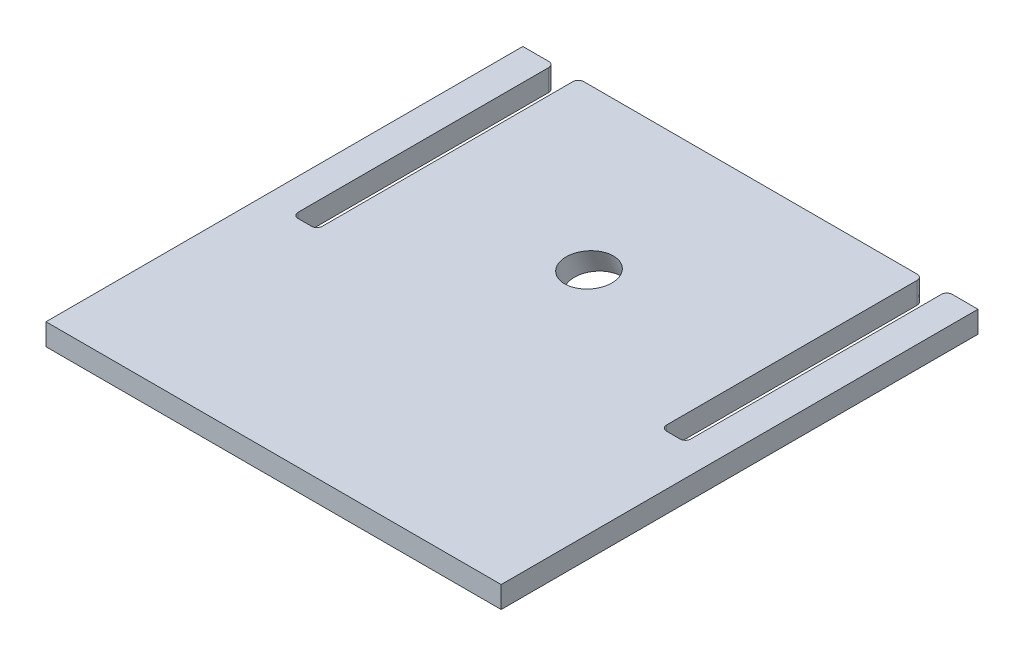
ISO-10303-21;
HEADER;
FILE_DESCRIPTION(('STEP AP214'),'2;1');
FILE_NAME('part.step','',(''),(''),'','','');
FILE_SCHEMA(('AUTOMOTIVE_DESIGN { 1 0 10303 214 1 1 1 1 }'));
ENDSEC;
DATA;
#1=APPLICATION_CONTEXT('core data for automotive mechanical design processes');
#2=APPLICATION_PROTOCOL_DEFINITION('international standard','automotive_design',2000,#1);
#3=PRODUCT_CONTEXT('',#1,'mechanical');
#4=PRODUCT('Part','Part','',(#3));
#5=PRODUCT_RELATED_PRODUCT_CATEGORY('part','',(#4));
#6=PRODUCT_DEFINITION_FORMATION('','',#4);
#7=PRODUCT_DEFINITION_CONTEXT('part definition',#1,'design');
#8=PRODUCT_DEFINITION('design','',#6,#7);
#9=PRODUCT_DEFINITION_SHAPE('','',#8);
#10=(LENGTH_UNIT() NAMED_UNIT(*) SI_UNIT(.MILLI.,.METRE.));
#11=(NAMED_UNIT(*) PLANE_ANGLE_UNIT() SI_UNIT($,.RADIAN.));
#12=(NAMED_UNIT(*) SI_UNIT($,.STERADIAN.) SOLID_ANGLE_UNIT());
#13=UNCERTAINTY_MEASURE_WITH_UNIT(LENGTH_MEASURE(1.E-05),#10,'distance_accuracy_value','');
#14=(GEOMETRIC_REPRESENTATION_CONTEXT(3) GLOBAL_UNCERTAINTY_ASSIGNED_CONTEXT((#13)) GLOBAL_UNIT_ASSIGNED_CONTEXT((#10,
#11,#12)) REPRESENTATION_CONTEXT('',''));
#15=CARTESIAN_POINT('',(0.,0.,0.));
#16=DIRECTION('',(0.,0.,1.));
#17=DIRECTION('',(1.,0.,0.));
#18=AXIS2_PLACEMENT_3D('',#15,#16,#17);
#19=CARTESIAN_POINT('',(-165.1,6.35,-139.7));
#20=DIRECTION('',(0.,0.,1.));
#21=DIRECTION('',(1.,0.,0.));
#22=AXIS2_PLACEMENT_3D('',#19,#20,#21);
#23=PLANE('',#22);
#24=DIRECTION('',(-1.,0.,0.));
#25=VECTOR('',#24,1.);
#26=CARTESIAN_POINT('',(-165.1,6.35,-139.7));
#27=LINE('',#26,#25);
#28=CARTESIAN_POINT('',(-118.237,6.35,-139.7));
#29=VERTEX_POINT('',#28);
#30=CARTESIAN_POINT('',(-133.35,6.35,-139.7));
#31=VERTEX_POINT('',#30);
#32=EDGE_CURVE('E412',#29,#31,#27,.T.);
#33=ORIENTED_EDGE('',*,*,#32,.F.);
#34=DIRECTION('',(0.,1.,0.));
#35=VECTOR('',#34,1.);
#36=CARTESIAN_POINT('',(-118.237,6.35,-139.7));
#37=LINE('',#36,#35);
#38=CARTESIAN_POINT('',(-118.237,-6.35,-139.7));
#39=VERTEX_POINT('',#38);
#40=EDGE_CURVE('E194',#29,#39,#37,.F.);
#41=ORIENTED_EDGE('',*,*,#40,.T.);
#42=DIRECTION('',(-1.,0.,0.));
#43=VECTOR('',#42,1.);
#44=CARTESIAN_POINT('',(-165.1,-6.35,-139.7));
#45=LINE('',#44,#43);
#46=CARTESIAN_POINT('',(-133.35,-6.35,-139.7));
#47=VERTEX_POINT('',#46);
#48=EDGE_CURVE('E189',#39,#47,#45,.T.);
#49=ORIENTED_EDGE('',*,*,#48,.T.);
#50=DIRECTION('',(0.,1.,0.));
#51=VECTOR('',#50,1.);
#52=CARTESIAN_POINT('',(-133.35,-6.35,-139.7));
#53=LINE('',#52,#51);
#54=EDGE_CURVE('E192',#47,#31,#53,.T.);
#55=ORIENTED_EDGE('',*,*,#54,.T.);
#56=EDGE_LOOP('',(#33,#41,#49,#55));
#57=FACE_BOUND('',#56,.T.);
#58=ADVANCED_FACE('F49',(#57),#23,.F.);
#59=CARTESIAN_POINT('',(133.35,-6.35,-139.7));
#60=VERTEX_POINT('',#59);
#61=CARTESIAN_POINT('',(118.237,-6.35,-139.7));
#62=VERTEX_POINT('',#61);
#63=EDGE_CURVE('E200',#60,#62,#45,.T.);
#64=ORIENTED_EDGE('',*,*,#63,.T.);
#65=DIRECTION('',(0.,1.,0.));
#66=VECTOR('',#65,1.);
#67=CARTESIAN_POINT('',(118.237,6.35,-139.7));
#68=LINE('',#67,#66);
#69=CARTESIAN_POINT('',(118.237,6.35,-139.7));
#70=VERTEX_POINT('',#69);
#71=EDGE_CURVE('E315',#62,#70,#68,.T.);
#72=ORIENTED_EDGE('',*,*,#71,.T.);
#73=CARTESIAN_POINT('',(133.35,6.35,-139.7));
#74=VERTEX_POINT('',#73);
#75=EDGE_CURVE('E411',#74,#70,#27,.T.);
#76=ORIENTED_EDGE('',*,*,#75,.F.);
#77=DIRECTION('',(0.,1.,0.));
#78=VECTOR('',#77,1.);
#79=CARTESIAN_POINT('',(133.35,-6.35,-139.7));
#80=LINE('',#79,#78);
#81=EDGE_CURVE('E420',#60,#74,#80,.T.);
#82=ORIENTED_EDGE('',*,*,#81,.F.);
#83=EDGE_LOOP('',(#64,#72,#76,#82));
#84=FACE_BOUND('',#83,.T.);
#85=ADVANCED_FACE('F437',(#84),#23,.F.);
#86=CARTESIAN_POINT('',(97.663,6.35,-139.7));
#87=VERTEX_POINT('',#86);
#88=CARTESIAN_POINT('',(-97.663,6.35,-139.7));
#89=VERTEX_POINT('',#88);
#90=EDGE_CURVE('E226',#87,#89,#27,.T.);
#91=ORIENTED_EDGE('',*,*,#90,.F.);
#92=DIRECTION('',(0.,1.,0.));
#93=VECTOR('',#92,1.);
#94=CARTESIAN_POINT('',(97.663,6.35,-139.7));
#95=LINE('',#94,#93);
#96=CARTESIAN_POINT('',(97.663,-6.35,-139.7));
#97=VERTEX_POINT('',#96);
#98=EDGE_CURVE('E301',#87,#97,#95,.F.);
#99=ORIENTED_EDGE('',*,*,#98,.T.);
#100=CARTESIAN_POINT('',(-97.663,-6.35,-139.7));
#101=VERTEX_POINT('',#100);
#102=EDGE_CURVE('E199',#97,#101,#45,.T.);
#103=ORIENTED_EDGE('',*,*,#102,.T.);
#104=DIRECTION('',(0.,1.,0.));
#105=VECTOR('',#104,1.);
#106=CARTESIAN_POINT('',(-97.663,6.35,-139.7));
#107=LINE('',#106,#105);
#108=EDGE_CURVE('E297',#101,#89,#107,.T.);
#109=ORIENTED_EDGE('',*,*,#108,.T.);
#110=EDGE_LOOP('',(#91,#99,#103,#109));
#111=FACE_BOUND('',#110,.T.);
#112=ADVANCED_FACE('F398',(#111),#23,.F.);
#113=CARTESIAN_POINT('',(-165.1,6.35,139.7));
#114=DIRECTION('',(0.,0.,-1.));
#115=DIRECTION('',(-1.,0.,0.));
#116=AXIS2_PLACEMENT_3D('',#113,#114,#115);
#117=PLANE('',#116);
#118=DIRECTION('',(1.,0.,0.));
#119=VECTOR('',#118,1.);
#120=CARTESIAN_POINT('',(-165.1,6.35,139.7));
#121=LINE('',#120,#119);
#122=CARTESIAN_POINT('',(-133.35,6.35,139.7));
#123=VERTEX_POINT('',#122);
#124=CARTESIAN_POINT('',(133.35,6.35,139.7));
#125=VERTEX_POINT('',#124);
#126=EDGE_CURVE('E407',#123,#125,#121,.T.);
#127=ORIENTED_EDGE('',*,*,#126,.F.);
#128=DIRECTION('',(0.,1.,0.));
#129=VECTOR('',#128,1.);
#130=CARTESIAN_POINT('',(-133.35,-6.35,139.7));
#131=LINE('',#130,#129);
#132=CARTESIAN_POINT('',(-133.35,-6.35,139.7));
#133=VERTEX_POINT('',#132);
#134=EDGE_CURVE('E278',#133,#123,#131,.T.);
#135=ORIENTED_EDGE('',*,*,#134,.F.);
#136=DIRECTION('',(1.,0.,0.));
#137=VECTOR('',#136,1.);
#138=CARTESIAN_POINT('',(-165.1,-6.35,139.7));
#139=LINE('',#138,#137);
#140=CARTESIAN_POINT('',(133.35,-6.35,139.7));
#141=VERTEX_POINT('',#140);
#142=EDGE_CURVE('E215',#133,#141,#139,.T.);
#143=ORIENTED_EDGE('',*,*,#142,.T.);
#144=DIRECTION('',(0.,1.,0.));
#145=VECTOR('',#144,1.);
#146=CARTESIAN_POINT('',(133.35,-6.35,139.7));
#147=LINE('',#146,#145);
#148=EDGE_CURVE('E404',#141,#125,#147,.T.);
#149=ORIENTED_EDGE('',*,*,#148,.T.);
#150=EDGE_LOOP('',(#127,#135,#143,#149));
#151=FACE_BOUND('',#150,.T.);
#152=ADVANCED_FACE('F431',(#151),#117,.F.);
#153=CARTESIAN_POINT('',(0.,6.35,0.));
#154=DIRECTION('',(0.,-1.,0.));
#155=DIRECTION('',(0.,0.,-1.));
#156=AXIS2_PLACEMENT_3D('',#153,#154,#155);
#157=PLANE('',#156);
#158=CARTESIAN_POINT('',(-0.577885440566899,6.34999999999999,-45.697273091108));
#159=DIRECTION('',(0.,-1.,0.));
#160=DIRECTION('',(-0.0211224465512653,0.,0.9997768962382));
#161=AXIS2_PLACEMENT_3D('',#158,#159,#160);
#162=ELLIPSE('',#161,14.2470282966305,13.335);
#163=CARTESIAN_POINT('',(-0.87881753427684,6.34999999999999,-31.453423360085));
#164=VERTEX_POINT('',#163);
#165=EDGE_CURVE('E273',#164,#164,#162,.F.);
#166=ORIENTED_EDGE('',*,*,#165,.F.);
#167=EDGE_LOOP('',(#166));
#168=FACE_BOUND('',#167,.T.);
#169=DIRECTION('',(0.,0.,1.));
#170=VECTOR('',#169,1.);
#171=CARTESIAN_POINT('',(100.838,6.35,-139.7));
#172=LINE('',#171,#170);
#173=CARTESIAN_POINT('',(100.838,6.35,-136.525));
#174=VERTEX_POINT('',#173);
#175=CARTESIAN_POINT('',(100.838,6.35,10.287));
#176=VERTEX_POINT('',#175);
#177=EDGE_CURVE('E242',#174,#176,#172,.T.);
#178=ORIENTED_EDGE('',*,*,#177,.F.);
#179=CARTESIAN_POINT('',(97.663,6.35,-136.525));
#180=DIRECTION('',(0.,-1.,0.));
#181=DIRECTION('',(0.,0.,-1.));
#182=AXIS2_PLACEMENT_3D('',#179,#180,#181);
#183=CIRCLE('',#182,3.175);
#184=EDGE_CURVE('E294',#174,#87,#183,.F.);
#185=ORIENTED_EDGE('',*,*,#184,.T.);
#186=ORIENTED_EDGE('',*,*,#90,.T.);
#187=CARTESIAN_POINT('',(-97.663,6.35,-136.525));
#188=DIRECTION('',(0.,-1.,0.));
#189=DIRECTION('',(0.,0.,-1.));
#190=AXIS2_PLACEMENT_3D('',#187,#188,#189);
#191=CIRCLE('',#190,3.175);
#192=CARTESIAN_POINT('',(-100.838,6.35,-136.525));
#193=VERTEX_POINT('',#192);
#194=EDGE_CURVE('E285',#89,#193,#191,.F.);
#195=ORIENTED_EDGE('',*,*,#194,.T.);
#196=DIRECTION('',(0.,0.,-1.));
#197=VECTOR('',#196,1.);
#198=CARTESIAN_POINT('',(-100.838,6.35,-139.7));
#199=LINE('',#198,#197);
#200=CARTESIAN_POINT('',(-100.838,6.35,10.287));
#201=VERTEX_POINT('',#200);
#202=EDGE_CURVE('E230',#201,#193,#199,.T.);
#203=ORIENTED_EDGE('',*,*,#202,.F.);
#204=CARTESIAN_POINT('',(-104.013,6.35,10.287));
#205=DIRECTION('',(0.,-1.,0.));
#206=DIRECTION('',(0.,0.,-1.));
#207=AXIS2_PLACEMENT_3D('',#204,#205,#206);
#208=CIRCLE('',#207,3.175);
#209=CARTESIAN_POINT('',(-104.013,6.35,13.462));
#210=VERTEX_POINT('',#209);
#211=EDGE_CURVE('E58',#201,#210,#208,.T.);
#212=ORIENTED_EDGE('',*,*,#211,.T.);
#213=DIRECTION('',(1.,0.,0.));
#214=VECTOR('',#213,1.);
#215=CARTESIAN_POINT('',(-114.3,6.35,13.462));
#216=LINE('',#215,#214);
#217=CARTESIAN_POINT('',(-111.887,6.35,13.462));
#218=VERTEX_POINT('',#217);
#219=EDGE_CURVE('E234',#218,#210,#216,.T.);
#220=ORIENTED_EDGE('',*,*,#219,.F.);
#221=CARTESIAN_POINT('',(-111.887,6.35,10.287));
#222=DIRECTION('',(0.,-1.,0.));
#223=DIRECTION('',(0.,0.,-1.));
#224=AXIS2_PLACEMENT_3D('',#221,#222,#223);
#225=CIRCLE('',#224,3.175);
#226=CARTESIAN_POINT('',(-115.062,6.35,10.287));
#227=VERTEX_POINT('',#226);
#228=EDGE_CURVE('E367',#218,#227,#225,.T.);
#229=ORIENTED_EDGE('',*,*,#228,.T.);
#230=DIRECTION('',(0.,0.,1.));
#231=VECTOR('',#230,1.);
#232=CARTESIAN_POINT('',(-115.062,6.35,-139.7));
#233=LINE('',#232,#231);
#234=CARTESIAN_POINT('',(-115.062,6.35,-136.525));
#235=VERTEX_POINT('',#234);
#236=EDGE_CURVE('E235',#235,#227,#233,.T.);
#237=ORIENTED_EDGE('',*,*,#236,.F.);
#238=CARTESIAN_POINT('',(-118.237,6.35,-136.525));
#239=DIRECTION('',(0.,-1.,0.));
#240=DIRECTION('',(0.,0.,-1.));
#241=AXIS2_PLACEMENT_3D('',#238,#239,#240);
#242=CIRCLE('',#241,3.175);
#243=EDGE_CURVE('E288',#235,#29,#242,.F.);
#244=ORIENTED_EDGE('',*,*,#243,.T.);
#245=ORIENTED_EDGE('',*,*,#32,.T.);
#246=DIRECTION('',(0.,0.,-1.));
#247=VECTOR('',#246,1.);
#248=CARTESIAN_POINT('',(-133.35,6.35,-139.7));
#249=LINE('',#248,#247);
#250=EDGE_CURVE('E207',#123,#31,#249,.T.);
#251=ORIENTED_EDGE('',*,*,#250,.F.);
#252=ORIENTED_EDGE('',*,*,#126,.T.);
#253=DIRECTION('',(0.,0.,1.));
#254=VECTOR('',#253,1.);
#255=CARTESIAN_POINT('',(133.35,6.35,-139.7));
#256=LINE('',#255,#254);
#257=EDGE_CURVE('E239',#74,#125,#256,.T.);
#258=ORIENTED_EDGE('',*,*,#257,.F.);
#259=ORIENTED_EDGE('',*,*,#75,.T.);
#260=CARTESIAN_POINT('',(118.237,6.35,-136.525));
#261=DIRECTION('',(0.,-1.,0.));
#262=DIRECTION('',(0.,0.,-1.));
#263=AXIS2_PLACEMENT_3D('',#260,#261,#262);
#264=CIRCLE('',#263,3.175);
#265=CARTESIAN_POINT('',(115.062,6.35,-136.525));
#266=VERTEX_POINT('',#265);
#267=EDGE_CURVE('E291',#70,#266,#264,.F.);
#268=ORIENTED_EDGE('',*,*,#267,.T.);
#269=DIRECTION('',(0.,0.,-1.));
#270=VECTOR('',#269,1.);
#271=CARTESIAN_POINT('',(115.062,6.35,-139.7));
#272=LINE('',#271,#270);
#273=CARTESIAN_POINT('',(115.062,6.35,10.287));
#274=VERTEX_POINT('',#273);
#275=EDGE_CURVE('E267',#274,#266,#272,.T.);
#276=ORIENTED_EDGE('',*,*,#275,.F.);
#277=CARTESIAN_POINT('',(111.887,6.35,10.287));
#278=DIRECTION('',(0.,-1.,0.));
#279=DIRECTION('',(0.,0.,-1.));
#280=AXIS2_PLACEMENT_3D('',#277,#278,#279);
#281=CIRCLE('',#280,3.175);
#282=CARTESIAN_POINT('',(111.887,6.35,13.462));
#283=VERTEX_POINT('',#282);
#284=EDGE_CURVE('E355',#274,#283,#281,.T.);
#285=ORIENTED_EDGE('',*,*,#284,.T.);
#286=DIRECTION('',(1.,0.,0.));
#287=VECTOR('',#286,1.);
#288=CARTESIAN_POINT('',(114.3,6.35,13.462));
#289=LINE('',#288,#287);
#290=CARTESIAN_POINT('',(104.013,6.35,13.462));
#291=VERTEX_POINT('',#290);
#292=EDGE_CURVE('E255',#291,#283,#289,.T.);
#293=ORIENTED_EDGE('',*,*,#292,.F.);
#294=CARTESIAN_POINT('',(104.013,6.35,10.287));
#295=DIRECTION('',(0.,-1.,0.));
#296=DIRECTION('',(0.,0.,-1.));
#297=AXIS2_PLACEMENT_3D('',#294,#295,#296);
#298=CIRCLE('',#297,3.175);
#299=EDGE_CURVE('E361',#291,#176,#298,.T.);
#300=ORIENTED_EDGE('',*,*,#299,.T.);
#301=EDGE_LOOP('',(#178,#185,#186,#195,#203,#212,#220,#229,#237,#244,#245,#251,#252,#258,#259,
#268,#276,#285,#293,#300));
#302=FACE_BOUND('',#301,.T.);
#303=ADVANCED_FACE('F377',(#168,#302),#157,.F.);
#304=CARTESIAN_POINT('',(0.,-6.35,0.));
#305=DIRECTION('',(0.,-1.,0.));
#306=DIRECTION('',(0.,0.,-1.));
#307=AXIS2_PLACEMENT_3D('',#304,#305,#306);
#308=PLANE('',#307);
#309=CARTESIAN_POINT('',(-0.476989852233649,-6.35,-50.4729072915838));
#310=DIRECTION('',(0.,-1.,0.));
#311=DIRECTION('',(-0.0211224465512653,0.,0.9997768962382));
#312=AXIS2_PLACEMENT_3D('',#309,#310,#311);
#313=ELLIPSE('',#312,14.2470282966305,13.335);
#314=CARTESIAN_POINT('',(-0.77792194594359,-6.35,-36.2290575605608));
#315=VERTEX_POINT('',#314);
#316=EDGE_CURVE('E218',#315,#315,#313,.F.);
#317=ORIENTED_EDGE('',*,*,#316,.T.);
#318=EDGE_LOOP('',(#317));
#319=FACE_BOUND('',#318,.T.);
#320=ORIENTED_EDGE('',*,*,#102,.F.);
#321=CARTESIAN_POINT('',(97.663,-6.35,-136.525));
#322=DIRECTION('',(0.,-1.,0.));
#323=DIRECTION('',(0.,0.,-1.));
#324=AXIS2_PLACEMENT_3D('',#321,#322,#323);
#325=CIRCLE('',#324,3.175);
#326=CARTESIAN_POINT('',(100.838,-6.35,-136.525));
#327=VERTEX_POINT('',#326);
#328=EDGE_CURVE('E312',#97,#327,#325,.T.);
#329=ORIENTED_EDGE('',*,*,#328,.T.);
#330=DIRECTION('',(0.,0.,1.));
#331=VECTOR('',#330,1.);
#332=CARTESIAN_POINT('',(100.838,-6.35,-139.7));
#333=LINE('',#332,#331);
#334=CARTESIAN_POINT('',(100.838,-6.35,10.287));
#335=VERTEX_POINT('',#334);
#336=EDGE_CURVE('E251',#327,#335,#333,.T.);
#337=ORIENTED_EDGE('',*,*,#336,.T.);
#338=CARTESIAN_POINT('',(104.013,-6.35,10.287));
#339=DIRECTION('',(0.,-1.,0.));
#340=DIRECTION('',(0.,0.,-1.));
#341=AXIS2_PLACEMENT_3D('',#338,#339,#340);
#342=CIRCLE('',#341,3.175);
#343=CARTESIAN_POINT('',(104.013,-6.35,13.462));
#344=VERTEX_POINT('',#343);
#345=EDGE_CURVE('E364',#335,#344,#342,.F.);
#346=ORIENTED_EDGE('',*,*,#345,.T.);
#347=DIRECTION('',(1.,0.,0.));
#348=VECTOR('',#347,1.);
#349=CARTESIAN_POINT('',(114.3,-6.35,13.462));
#350=LINE('',#349,#348);
#351=CARTESIAN_POINT('',(111.887,-6.35,13.462));
#352=VERTEX_POINT('',#351);
#353=EDGE_CURVE('E259',#344,#352,#350,.T.);
#354=ORIENTED_EDGE('',*,*,#353,.T.);
#355=CARTESIAN_POINT('',(111.887,-6.35,10.287));
#356=DIRECTION('',(0.,-1.,0.));
#357=DIRECTION('',(0.,0.,-1.));
#358=AXIS2_PLACEMENT_3D('',#355,#356,#357);
#359=CIRCLE('',#358,3.175);
#360=CARTESIAN_POINT('',(115.062,-6.35,10.287));
#361=VERTEX_POINT('',#360);
#362=EDGE_CURVE('E358',#352,#361,#359,.F.);
#363=ORIENTED_EDGE('',*,*,#362,.T.);
#364=DIRECTION('',(0.,0.,-1.));
#365=VECTOR('',#364,1.);
#366=CARTESIAN_POINT('',(115.062,-6.35,-139.7));
#367=LINE('',#366,#365);
#368=CARTESIAN_POINT('',(115.062,-6.35,-136.525));
#369=VERTEX_POINT('',#368);
#370=EDGE_CURVE('E263',#361,#369,#367,.T.);
#371=ORIENTED_EDGE('',*,*,#370,.T.);
#372=CARTESIAN_POINT('',(118.237,-6.35,-136.525));
#373=DIRECTION('',(0.,-1.,0.));
#374=DIRECTION('',(0.,0.,-1.));
#375=AXIS2_PLACEMENT_3D('',#372,#373,#374);
#376=CIRCLE('',#375,3.175);
#377=EDGE_CURVE('E65',#369,#62,#376,.T.);
#378=ORIENTED_EDGE('',*,*,#377,.T.);
#379=ORIENTED_EDGE('',*,*,#63,.F.);
#380=DIRECTION('',(0.,0.,1.));
#381=VECTOR('',#380,1.);
#382=CARTESIAN_POINT('',(133.35,-6.35,-139.7));
#383=LINE('',#382,#381);
#384=EDGE_CURVE('E266',#60,#141,#383,.T.);
#385=ORIENTED_EDGE('',*,*,#384,.T.);
#386=ORIENTED_EDGE('',*,*,#142,.F.);
#387=DIRECTION('',(0.,0.,-1.));
#388=VECTOR('',#387,1.);
#389=CARTESIAN_POINT('',(-133.35,-6.35,-139.7));
#390=LINE('',#389,#388);
#391=EDGE_CURVE('E204',#133,#47,#390,.T.);
#392=ORIENTED_EDGE('',*,*,#391,.T.);
#393=ORIENTED_EDGE('',*,*,#48,.F.);
#394=CARTESIAN_POINT('',(-118.237,-6.35,-136.525));
#395=DIRECTION('',(0.,-1.,0.));
#396=DIRECTION('',(0.,0.,-1.));
#397=AXIS2_PLACEMENT_3D('',#394,#395,#396);
#398=CIRCLE('',#397,3.175);
#399=CARTESIAN_POINT('',(-115.062,-6.35,-136.525));
#400=VERTEX_POINT('',#399);
#401=EDGE_CURVE('E307',#39,#400,#398,.T.);
#402=ORIENTED_EDGE('',*,*,#401,.T.);
#403=DIRECTION('',(0.,0.,1.));
#404=VECTOR('',#403,1.);
#405=CARTESIAN_POINT('',(-115.062,-6.35,-139.7));
#406=LINE('',#405,#404);
#407=CARTESIAN_POINT('',(-115.062,-6.35,10.287));
#408=VERTEX_POINT('',#407);
#409=EDGE_CURVE('E217',#400,#408,#406,.T.);
#410=ORIENTED_EDGE('',*,*,#409,.T.);
#411=CARTESIAN_POINT('',(-111.887,-6.35,10.287));
#412=DIRECTION('',(0.,-1.,0.));
#413=DIRECTION('',(0.,0.,-1.));
#414=AXIS2_PLACEMENT_3D('',#411,#412,#413);
#415=CIRCLE('',#414,3.175);
#416=CARTESIAN_POINT('',(-111.887,-6.35,13.462));
#417=VERTEX_POINT('',#416);
#418=EDGE_CURVE('E370',#408,#417,#415,.F.);
#419=ORIENTED_EDGE('',*,*,#418,.T.);
#420=DIRECTION('',(1.,0.,0.));
#421=VECTOR('',#420,1.);
#422=CARTESIAN_POINT('',(-114.3,-6.35,13.462));
#423=LINE('',#422,#421);
#424=CARTESIAN_POINT('',(-104.013,-6.35,13.462));
#425=VERTEX_POINT('',#424);
#426=EDGE_CURVE('E223',#417,#425,#423,.T.);
#427=ORIENTED_EDGE('',*,*,#426,.T.);
#428=CARTESIAN_POINT('',(-104.013,-6.35,10.287));
#429=DIRECTION('',(0.,-1.,0.));
#430=DIRECTION('',(0.,0.,-1.));
#431=AXIS2_PLACEMENT_3D('',#428,#429,#430);
#432=CIRCLE('',#431,3.175);
#433=CARTESIAN_POINT('',(-100.838,-6.35,10.287));
#434=VERTEX_POINT('',#433);
#435=EDGE_CURVE('E12',#425,#434,#432,.F.);
#436=ORIENTED_EDGE('',*,*,#435,.T.);
#437=DIRECTION('',(0.,0.,-1.));
#438=VECTOR('',#437,1.);
#439=CARTESIAN_POINT('',(-100.838,-6.35,-139.7));
#440=LINE('',#439,#438);
#441=CARTESIAN_POINT('',(-100.838,-6.35,-136.525));
#442=VERTEX_POINT('',#441);
#443=EDGE_CURVE('E247',#434,#442,#440,.T.);
#444=ORIENTED_EDGE('',*,*,#443,.T.);
#445=CARTESIAN_POINT('',(-97.663,-6.35,-136.525));
#446=DIRECTION('',(0.,-1.,0.));
#447=DIRECTION('',(0.,0.,-1.));
#448=AXIS2_PLACEMENT_3D('',#445,#446,#447);
#449=CIRCLE('',#448,3.175);
#450=EDGE_CURVE('E304',#442,#101,#449,.T.);
#451=ORIENTED_EDGE('',*,*,#450,.T.);
#452=EDGE_LOOP('',(#320,#329,#337,#346,#354,#363,#371,#378,#379,#385,#386,#392,#393,#402,#410,
#419,#427,#436,#444,#451));
#453=FACE_BOUND('',#452,.T.);
#454=ADVANCED_FACE('F212',(#319,#453),#308,.T.);
#455=CARTESIAN_POINT('',(115.062,-6.35,-139.7));
#456=DIRECTION('',(1.,0.,0.));
#457=DIRECTION('',(0.,0.,-1.));
#458=AXIS2_PLACEMENT_3D('',#455,#456,#457);
#459=PLANE('',#458);
#460=ORIENTED_EDGE('',*,*,#275,.T.);
#461=DIRECTION('',(0.,1.,0.));
#462=VECTOR('',#461,1.);
#463=CARTESIAN_POINT('',(115.062,-6.35,-136.525));
#464=LINE('',#463,#462);
#465=EDGE_CURVE('E73',#266,#369,#464,.F.);
#466=ORIENTED_EDGE('',*,*,#465,.T.);
#467=ORIENTED_EDGE('',*,*,#370,.F.);
#468=DIRECTION('',(0.,1.,0.));
#469=VECTOR('',#468,1.);
#470=CARTESIAN_POINT('',(115.062,6.35,10.287));
#471=LINE('',#470,#469);
#472=EDGE_CURVE('E319',#361,#274,#471,.T.);
#473=ORIENTED_EDGE('',*,*,#472,.T.);
#474=EDGE_LOOP('',(#460,#466,#467,#473));
#475=FACE_BOUND('',#474,.T.);
#476=ADVANCED_FACE('F442',(#475),#459,.F.);
#477=CARTESIAN_POINT('',(114.3,-6.35,13.462));
#478=DIRECTION('',(0.,0.,1.));
#479=DIRECTION('',(1.,0.,0.));
#480=AXIS2_PLACEMENT_3D('',#477,#478,#479);
#481=PLANE('',#480);
#482=ORIENTED_EDGE('',*,*,#292,.T.);
#483=DIRECTION('',(0.,1.,0.));
#484=VECTOR('',#483,1.);
#485=CARTESIAN_POINT('',(111.887,-6.35,13.462));
#486=LINE('',#485,#484);
#487=EDGE_CURVE('E345',#283,#352,#486,.F.);
#488=ORIENTED_EDGE('',*,*,#487,.T.);
#489=ORIENTED_EDGE('',*,*,#353,.F.);
#490=DIRECTION('',(0.,1.,0.));
#491=VECTOR('',#490,1.);
#492=CARTESIAN_POINT('',(104.013,6.35,13.462));
#493=LINE('',#492,#491);
#494=EDGE_CURVE('E341',#344,#291,#493,.T.);
#495=ORIENTED_EDGE('',*,*,#494,.T.);
#496=EDGE_LOOP('',(#482,#488,#489,#495));
#497=FACE_BOUND('',#496,.T.);
#498=ADVANCED_FACE('F450',(#497),#481,.F.);
#499=CARTESIAN_POINT('',(100.838,-6.35,-139.7));
#500=DIRECTION('',(-1.,0.,0.));
#501=DIRECTION('',(0.,0.,1.));
#502=AXIS2_PLACEMENT_3D('',#499,#500,#501);
#503=PLANE('',#502);
#504=ORIENTED_EDGE('',*,*,#336,.F.);
#505=DIRECTION('',(0.,1.,0.));
#506=VECTOR('',#505,1.);
#507=CARTESIAN_POINT('',(100.838,-6.35,-136.525));
#508=LINE('',#507,#506);
#509=EDGE_CURVE('E281',#327,#174,#508,.T.);
#510=ORIENTED_EDGE('',*,*,#509,.T.);
#511=ORIENTED_EDGE('',*,*,#177,.T.);
#512=DIRECTION('',(0.,1.,0.));
#513=VECTOR('',#512,1.);
#514=CARTESIAN_POINT('',(100.838,-6.35,10.287));
#515=LINE('',#514,#513);
#516=EDGE_CURVE('E277',#176,#335,#515,.F.);
#517=ORIENTED_EDGE('',*,*,#516,.T.);
#518=EDGE_LOOP('',(#504,#510,#511,#517));
#519=FACE_BOUND('',#518,.T.);
#520=ADVANCED_FACE('F459',(#519),#503,.F.);
#521=CARTESIAN_POINT('',(-115.062,-6.35,-139.7));
#522=DIRECTION('',(-1.,0.,0.));
#523=DIRECTION('',(0.,0.,1.));
#524=AXIS2_PLACEMENT_3D('',#521,#522,#523);
#525=PLANE('',#524);
#526=ORIENTED_EDGE('',*,*,#409,.F.);
#527=DIRECTION('',(0.,1.,0.));
#528=VECTOR('',#527,1.);
#529=CARTESIAN_POINT('',(-115.062,-6.35,-136.525));
#530=LINE('',#529,#528);
#531=EDGE_CURVE('E328',#400,#235,#530,.T.);
#532=ORIENTED_EDGE('',*,*,#531,.T.);
#533=ORIENTED_EDGE('',*,*,#236,.T.);
#534=DIRECTION('',(0.,1.,0.));
#535=VECTOR('',#534,1.);
#536=CARTESIAN_POINT('',(-115.062,-6.35,10.287));
#537=LINE('',#536,#535);
#538=EDGE_CURVE('E325',#227,#408,#537,.F.);
#539=ORIENTED_EDGE('',*,*,#538,.T.);
#540=EDGE_LOOP('',(#526,#532,#533,#539));
#541=FACE_BOUND('',#540,.T.);
#542=ADVANCED_FACE('F503',(#541),#525,.F.);
#543=CARTESIAN_POINT('',(-100.838,-6.35,-139.7));
#544=DIRECTION('',(1.,0.,0.));
#545=DIRECTION('',(0.,0.,-1.));
#546=AXIS2_PLACEMENT_3D('',#543,#544,#545);
#547=PLANE('',#546);
#548=ORIENTED_EDGE('',*,*,#202,.T.);
#549=DIRECTION('',(0.,1.,0.));
#550=VECTOR('',#549,1.);
#551=CARTESIAN_POINT('',(-100.838,-6.35,-136.525));
#552=LINE('',#551,#550);
#553=EDGE_CURVE('E338',#193,#442,#552,.F.);
#554=ORIENTED_EDGE('',*,*,#553,.T.);
#555=ORIENTED_EDGE('',*,*,#443,.F.);
#556=DIRECTION('',(0.,1.,0.));
#557=VECTOR('',#556,1.);
#558=CARTESIAN_POINT('',(-100.838,6.35,10.287));
#559=LINE('',#558,#557);
#560=EDGE_CURVE('E334',#434,#201,#559,.T.);
#561=ORIENTED_EDGE('',*,*,#560,.T.);
#562=EDGE_LOOP('',(#548,#554,#555,#561));
#563=FACE_BOUND('',#562,.T.);
#564=ADVANCED_FACE('F389',(#563),#547,.F.);
#565=CARTESIAN_POINT('',(-114.3,-6.35,13.462));
#566=DIRECTION('',(0.,0.,1.));
#567=DIRECTION('',(1.,0.,0.));
#568=AXIS2_PLACEMENT_3D('',#565,#566,#567);
#569=PLANE('',#568);
#570=ORIENTED_EDGE('',*,*,#426,.F.);
#571=DIRECTION('',(0.,1.,0.));
#572=VECTOR('',#571,1.);
#573=CARTESIAN_POINT('',(-111.887,6.35,13.462));
#574=LINE('',#573,#572);
#575=EDGE_CURVE('E351',#417,#218,#574,.T.);
#576=ORIENTED_EDGE('',*,*,#575,.T.);
#577=ORIENTED_EDGE('',*,*,#219,.T.);
#578=DIRECTION('',(0.,1.,0.));
#579=VECTOR('',#578,1.);
#580=CARTESIAN_POINT('',(-104.013,-6.35,13.462));
#581=LINE('',#580,#579);
#582=EDGE_CURVE('E348',#210,#425,#581,.F.);
#583=ORIENTED_EDGE('',*,*,#582,.T.);
#584=EDGE_LOOP('',(#570,#576,#577,#583));
#585=FACE_BOUND('',#584,.T.);
#586=ADVANCED_FACE('F383',(#585),#569,.F.);
#587=CARTESIAN_POINT('',(133.35,-6.35,-139.7));
#588=DIRECTION('',(-1.,0.,0.));
#589=DIRECTION('',(0.,0.,1.));
#590=AXIS2_PLACEMENT_3D('',#587,#588,#589);
#591=PLANE('',#590);
#592=ORIENTED_EDGE('',*,*,#257,.T.);
#593=ORIENTED_EDGE('',*,*,#148,.F.);
#594=ORIENTED_EDGE('',*,*,#384,.F.);
#595=ORIENTED_EDGE('',*,*,#81,.T.);
#596=EDGE_LOOP('',(#592,#593,#594,#595));
#597=FACE_BOUND('',#596,.T.);
#598=ADVANCED_FACE('F433',(#597),#591,.F.);
#599=CARTESIAN_POINT('',(-133.35,-6.35,-139.7));
#600=DIRECTION('',(1.,0.,0.));
#601=DIRECTION('',(0.,0.,-1.));
#602=AXIS2_PLACEMENT_3D('',#599,#600,#601);
#603=PLANE('',#602);
#604=ORIENTED_EDGE('',*,*,#250,.T.);
#605=ORIENTED_EDGE('',*,*,#54,.F.);
#606=ORIENTED_EDGE('',*,*,#391,.F.);
#607=ORIENTED_EDGE('',*,*,#134,.T.);
#608=EDGE_LOOP('',(#604,#605,#606,#607));
#609=FACE_BOUND('',#608,.T.);
#610=ADVANCED_FACE('F203',(#609),#603,.F.);
#611=CARTESIAN_POINT('',(1.32116539930394E-11,-66.3900000000675,-73.0500000000001));
#612=DIRECTION('',(-0.00743596247190496,0.935984664475875,0.351962234235576));
#613=DIRECTION('',(0.,-0.351971965257692,0.936010542500798));
#614=AXIS2_PLACEMENT_3D('',#611,#612,#613);
#615=CYLINDRICAL_SURFACE('',#614,13.335);
#616=ORIENTED_EDGE('',*,*,#316,.F.);
#617=EDGE_LOOP('',(#616));
#618=FACE_BOUND('',#617,.T.);
#619=ORIENTED_EDGE('',*,*,#165,.T.);
#620=EDGE_LOOP('',(#619));
#621=FACE_BOUND('',#620,.T.);
#622=ADVANCED_FACE('F466',(#618,#621),#615,.F.);
#623=CARTESIAN_POINT('',(97.663,-6.35,-136.525));
#624=DIRECTION('',(0.,1.,0.));
#625=DIRECTION('',(0.,0.,1.));
#626=AXIS2_PLACEMENT_3D('',#623,#624,#625);
#627=CYLINDRICAL_SURFACE('',#626,3.175);
#628=ORIENTED_EDGE('',*,*,#328,.F.);
#629=ORIENTED_EDGE('',*,*,#98,.F.);
#630=ORIENTED_EDGE('',*,*,#184,.F.);
#631=ORIENTED_EDGE('',*,*,#509,.F.);
#632=EDGE_LOOP('',(#628,#629,#630,#631));
#633=FACE_BOUND('',#632,.T.);
#634=ADVANCED_FACE('F462',(#633),#627,.T.);
#635=CARTESIAN_POINT('',(118.237,6.35,-136.525));
#636=DIRECTION('',(0.,1.,0.));
#637=DIRECTION('',(0.,0.,1.));
#638=AXIS2_PLACEMENT_3D('',#635,#636,#637);
#639=CYLINDRICAL_SURFACE('',#638,3.175);
#640=ORIENTED_EDGE('',*,*,#377,.F.);
#641=ORIENTED_EDGE('',*,*,#465,.F.);
#642=ORIENTED_EDGE('',*,*,#267,.F.);
#643=ORIENTED_EDGE('',*,*,#71,.F.);
#644=EDGE_LOOP('',(#640,#641,#642,#643));
#645=FACE_BOUND('',#644,.T.);
#646=ADVANCED_FACE('F440',(#645),#639,.T.);
#647=CARTESIAN_POINT('',(-118.237,-6.35,-136.525));
#648=DIRECTION('',(0.,1.,0.));
#649=DIRECTION('',(0.,0.,1.));
#650=AXIS2_PLACEMENT_3D('',#647,#648,#649);
#651=CYLINDRICAL_SURFACE('',#650,3.175);
#652=ORIENTED_EDGE('',*,*,#401,.F.);
#653=ORIENTED_EDGE('',*,*,#40,.F.);
#654=ORIENTED_EDGE('',*,*,#243,.F.);
#655=ORIENTED_EDGE('',*,*,#531,.F.);
#656=EDGE_LOOP('',(#652,#653,#654,#655));
#657=FACE_BOUND('',#656,.T.);
#658=ADVANCED_FACE('F472',(#657),#651,.T.);
#659=CARTESIAN_POINT('',(-97.663,6.35,-136.525));
#660=DIRECTION('',(0.,1.,0.));
#661=DIRECTION('',(0.,0.,1.));
#662=AXIS2_PLACEMENT_3D('',#659,#660,#661);
#663=CYLINDRICAL_SURFACE('',#662,3.175);
#664=ORIENTED_EDGE('',*,*,#450,.F.);
#665=ORIENTED_EDGE('',*,*,#553,.F.);
#666=ORIENTED_EDGE('',*,*,#194,.F.);
#667=ORIENTED_EDGE('',*,*,#108,.F.);
#668=EDGE_LOOP('',(#664,#665,#666,#667));
#669=FACE_BOUND('',#668,.T.);
#670=ADVANCED_FACE('F392',(#669),#663,.T.);
#671=CARTESIAN_POINT('',(111.887,-6.35,10.287));
#672=DIRECTION('',(0.,-1.,0.));
#673=DIRECTION('',(0.,0.,-1.));
#674=AXIS2_PLACEMENT_3D('',#671,#672,#673);
#675=CYLINDRICAL_SURFACE('',#674,3.175);
#676=ORIENTED_EDGE('',*,*,#362,.F.);
#677=ORIENTED_EDGE('',*,*,#487,.F.);
#678=ORIENTED_EDGE('',*,*,#284,.F.);
#679=ORIENTED_EDGE('',*,*,#472,.F.);
#680=EDGE_LOOP('',(#676,#677,#678,#679));
#681=FACE_BOUND('',#680,.T.);
#682=ADVANCED_FACE('F446',(#681),#675,.F.);
#683=CARTESIAN_POINT('',(104.013,-6.35,10.287));
#684=DIRECTION('',(0.,-1.,0.));
#685=DIRECTION('',(0.,0.,-1.));
#686=AXIS2_PLACEMENT_3D('',#683,#684,#685);
#687=CYLINDRICAL_SURFACE('',#686,3.175);
#688=ORIENTED_EDGE('',*,*,#345,.F.);
#689=ORIENTED_EDGE('',*,*,#516,.F.);
#690=ORIENTED_EDGE('',*,*,#299,.F.);
#691=ORIENTED_EDGE('',*,*,#494,.F.);
#692=EDGE_LOOP('',(#688,#689,#690,#691));
#693=FACE_BOUND('',#692,.T.);
#694=ADVANCED_FACE('F455',(#693),#687,.F.);
#695=CARTESIAN_POINT('',(-111.887,-6.35,10.287));
#696=DIRECTION('',(0.,-1.,0.));
#697=DIRECTION('',(0.,0.,-1.));
#698=AXIS2_PLACEMENT_3D('',#695,#696,#697);
#699=CYLINDRICAL_SURFACE('',#698,3.175);
#700=ORIENTED_EDGE('',*,*,#418,.F.);
#701=ORIENTED_EDGE('',*,*,#538,.F.);
#702=ORIENTED_EDGE('',*,*,#228,.F.);
#703=ORIENTED_EDGE('',*,*,#575,.F.);
#704=EDGE_LOOP('',(#700,#701,#702,#703));
#705=FACE_BOUND('',#704,.T.);
#706=ADVANCED_FACE('F586',(#705),#699,.F.);
#707=CARTESIAN_POINT('',(-104.013,-6.35,10.287));
#708=DIRECTION('',(0.,-1.,0.));
#709=DIRECTION('',(0.,0.,-1.));
#710=AXIS2_PLACEMENT_3D('',#707,#708,#709);
#711=CYLINDRICAL_SURFACE('',#710,3.175);
#712=ORIENTED_EDGE('',*,*,#435,.F.);
#713=ORIENTED_EDGE('',*,*,#582,.F.);
#714=ORIENTED_EDGE('',*,*,#211,.F.);
#715=ORIENTED_EDGE('',*,*,#560,.F.);
#716=EDGE_LOOP('',(#712,#713,#714,#715));
#717=FACE_BOUND('',#716,.T.);
#718=ADVANCED_FACE('F51',(#717),#711,.F.);
#719=CLOSED_SHELL('',(#58,#85,#112,#152,#303,#454,#476,#498,#520,#542,#564,#586,#598,#610,#622,
#634,#646,#658,#670,#682,#694,#706,#718));
#720=MANIFOLD_SOLID_BREP('B2',#719);
#721=ADVANCED_BREP_SHAPE_REPRESENTATION('',(#18,#720),#14);
#722=SHAPE_DEFINITION_REPRESENTATION(#9,#721);
ENDSEC;
END-ISO-10303-21;
